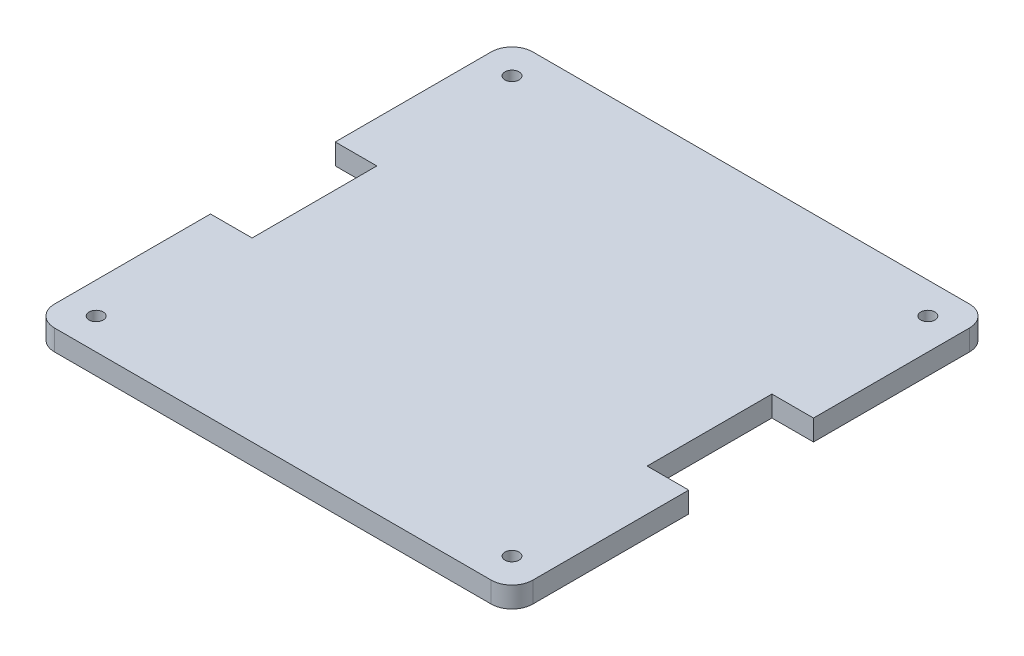
ISO-10303-21;
HEADER;
FILE_DESCRIPTION(('STEP AP214'),'2;1');
FILE_NAME('part.step','',(''),(''),'','','');
FILE_SCHEMA(('AUTOMOTIVE_DESIGN { 1 0 10303 214 1 1 1 1 }'));
ENDSEC;
DATA;
#1=APPLICATION_CONTEXT('core data for automotive mechanical design processes');
#2=APPLICATION_PROTOCOL_DEFINITION('international standard','automotive_design',2000,#1);
#3=PRODUCT_CONTEXT('',#1,'mechanical');
#4=PRODUCT('Part','Part','',(#3));
#5=PRODUCT_RELATED_PRODUCT_CATEGORY('part','',(#4));
#6=PRODUCT_DEFINITION_FORMATION('','',#4);
#7=PRODUCT_DEFINITION_CONTEXT('part definition',#1,'design');
#8=PRODUCT_DEFINITION('design','',#6,#7);
#9=PRODUCT_DEFINITION_SHAPE('','',#8);
#10=(LENGTH_UNIT() NAMED_UNIT(*) SI_UNIT(.MILLI.,.METRE.));
#11=(NAMED_UNIT(*) PLANE_ANGLE_UNIT() SI_UNIT($,.RADIAN.));
#12=(NAMED_UNIT(*) SI_UNIT($,.STERADIAN.) SOLID_ANGLE_UNIT());
#13=UNCERTAINTY_MEASURE_WITH_UNIT(LENGTH_MEASURE(1.E-05),#10,'distance_accuracy_value','');
#14=(GEOMETRIC_REPRESENTATION_CONTEXT(3) GLOBAL_UNCERTAINTY_ASSIGNED_CONTEXT((#13)) GLOBAL_UNIT_ASSIGNED_CONTEXT((#10,
#11,#12)) REPRESENTATION_CONTEXT('',''));
#15=CARTESIAN_POINT('',(0.,0.,0.));
#16=DIRECTION('',(0.,0.,1.));
#17=DIRECTION('',(1.,0.,0.));
#18=AXIS2_PLACEMENT_3D('',#15,#16,#17);
#19=CARTESIAN_POINT('',(-73.025,6.35,73.025));
#20=DIRECTION('',(1.,0.,0.));
#21=DIRECTION('',(0.,0.,-1.));
#22=AXIS2_PLACEMENT_3D('',#19,#20,#21);
#23=PLANE('',#22);
#24=DIRECTION('',(0.,1.,0.));
#25=VECTOR('',#24,1.);
#26=CARTESIAN_POINT('',(-73.025,-40.1609262841384,-19.05));
#27=LINE('',#26,#25);
#28=CARTESIAN_POINT('',(-73.025,0.,-19.05));
#29=VERTEX_POINT('',#28);
#30=CARTESIAN_POINT('',(-73.025,6.35,-19.05));
#31=VERTEX_POINT('',#30);
#32=EDGE_CURVE('E146',#29,#31,#27,.T.);
#33=ORIENTED_EDGE('',*,*,#32,.T.);
#34=DIRECTION('',(0.,0.,1.));
#35=VECTOR('',#34,1.);
#36=CARTESIAN_POINT('',(-73.025,6.35,73.025));
#37=LINE('',#36,#35);
#38=CARTESIAN_POINT('',(-73.025,6.35,-66.675));
#39=VERTEX_POINT('',#38);
#40=EDGE_CURVE('E239',#39,#31,#37,.T.);
#41=ORIENTED_EDGE('',*,*,#40,.F.);
#42=DIRECTION('',(0.,-1.,0.));
#43=VECTOR('',#42,1.);
#44=CARTESIAN_POINT('',(-73.025,6.35,-66.675));
#45=LINE('',#44,#43);
#46=CARTESIAN_POINT('',(-73.025,0.,-66.675));
#47=VERTEX_POINT('',#46);
#48=EDGE_CURVE('E167',#39,#47,#45,.T.);
#49=ORIENTED_EDGE('',*,*,#48,.T.);
#50=DIRECTION('',(0.,0.,1.));
#51=VECTOR('',#50,1.);
#52=CARTESIAN_POINT('',(-73.025,0.,73.025));
#53=LINE('',#52,#51);
#54=EDGE_CURVE('E161',#47,#29,#53,.T.);
#55=ORIENTED_EDGE('',*,*,#54,.T.);
#56=EDGE_LOOP('',(#33,#41,#49,#55));
#57=FACE_BOUND('',#56,.T.);
#58=ADVANCED_FACE('F33',(#57),#23,.F.);
#59=DIRECTION('',(0.,1.,0.));
#60=VECTOR('',#59,1.);
#61=CARTESIAN_POINT('',(-73.025,-40.1609262841384,19.05));
#62=LINE('',#61,#60);
#63=CARTESIAN_POINT('',(-73.025,0.,19.05));
#64=VERTEX_POINT('',#63);
#65=CARTESIAN_POINT('',(-73.025,6.35,19.05));
#66=VERTEX_POINT('',#65);
#67=EDGE_CURVE('E156',#64,#66,#62,.T.);
#68=ORIENTED_EDGE('',*,*,#67,.F.);
#69=CARTESIAN_POINT('',(-73.025,0.,66.675));
#70=VERTEX_POINT('',#69);
#71=EDGE_CURVE('E169',#64,#70,#53,.T.);
#72=ORIENTED_EDGE('',*,*,#71,.T.);
#73=DIRECTION('',(0.,-1.,0.));
#74=VECTOR('',#73,1.);
#75=CARTESIAN_POINT('',(-73.025,6.35,66.675));
#76=LINE('',#75,#74);
#77=CARTESIAN_POINT('',(-73.025,6.35,66.675));
#78=VERTEX_POINT('',#77);
#79=EDGE_CURVE('E195',#70,#78,#76,.F.);
#80=ORIENTED_EDGE('',*,*,#79,.T.);
#81=EDGE_CURVE('E225',#66,#78,#37,.T.);
#82=ORIENTED_EDGE('',*,*,#81,.F.);
#83=EDGE_LOOP('',(#68,#72,#80,#82));
#84=FACE_BOUND('',#83,.T.);
#85=ADVANCED_FACE('F311',(#84),#23,.F.);
#86=CARTESIAN_POINT('',(0.,6.35,0.));
#87=DIRECTION('',(0.,-1.,0.));
#88=DIRECTION('',(0.,0.,-1.));
#89=AXIS2_PLACEMENT_3D('',#86,#87,#88);
#90=PLANE('',#89);
#91=CARTESIAN_POINT('',(-63.5,6.35,-63.5));
#92=DIRECTION('',(0.,1.,0.));
#93=DIRECTION('',(0.,0.,1.));
#94=AXIS2_PLACEMENT_3D('',#91,#92,#93);
#95=CIRCLE('',#94,2.15265000000001);
#96=CARTESIAN_POINT('',(-63.5,6.35,-61.34735));
#97=VERTEX_POINT('',#96);
#98=EDGE_CURVE('E245',#97,#97,#95,.T.);
#99=ORIENTED_EDGE('',*,*,#98,.F.);
#100=EDGE_LOOP('',(#99));
#101=FACE_BOUND('',#100,.T.);
#102=CARTESIAN_POINT('',(63.5,6.35,-63.5));
#103=DIRECTION('',(0.,1.,0.));
#104=DIRECTION('',(0.,0.,1.));
#105=AXIS2_PLACEMENT_3D('',#102,#103,#104);
#106=CIRCLE('',#105,2.15265000000001);
#107=CARTESIAN_POINT('',(63.5,6.35,-61.34735));
#108=VERTEX_POINT('',#107);
#109=EDGE_CURVE('E251',#108,#108,#106,.T.);
#110=ORIENTED_EDGE('',*,*,#109,.F.);
#111=EDGE_LOOP('',(#110));
#112=FACE_BOUND('',#111,.T.);
#113=CARTESIAN_POINT('',(63.5,6.35,63.5));
#114=DIRECTION('',(0.,1.,0.));
#115=DIRECTION('',(0.,0.,1.));
#116=AXIS2_PLACEMENT_3D('',#113,#114,#115);
#117=CIRCLE('',#116,2.15265000000001);
#118=CARTESIAN_POINT('',(63.5,6.35,65.65265));
#119=VERTEX_POINT('',#118);
#120=EDGE_CURVE('E257',#119,#119,#117,.T.);
#121=ORIENTED_EDGE('',*,*,#120,.F.);
#122=EDGE_LOOP('',(#121));
#123=FACE_BOUND('',#122,.T.);
#124=CARTESIAN_POINT('',(-63.5,6.35,63.5));
#125=DIRECTION('',(0.,1.,0.));
#126=DIRECTION('',(0.,0.,1.));
#127=AXIS2_PLACEMENT_3D('',#124,#125,#126);
#128=CIRCLE('',#127,2.15265000000001);
#129=CARTESIAN_POINT('',(-63.5,6.35,65.65265));
#130=VERTEX_POINT('',#129);
#131=EDGE_CURVE('E263',#130,#130,#128,.T.);
#132=ORIENTED_EDGE('',*,*,#131,.F.);
#133=EDGE_LOOP('',(#132));
#134=FACE_BOUND('',#133,.T.);
#135=DIRECTION('',(1.,0.,0.));
#136=VECTOR('',#135,1.);
#137=CARTESIAN_POINT('',(-60.325,6.35,-19.05));
#138=LINE('',#137,#136);
#139=CARTESIAN_POINT('',(-60.325,6.35,-19.05));
#140=VERTEX_POINT('',#139);
#141=EDGE_CURVE('E151',#31,#140,#138,.T.);
#142=ORIENTED_EDGE('',*,*,#141,.T.);
#143=DIRECTION('',(0.,0.,1.));
#144=VECTOR('',#143,1.);
#145=CARTESIAN_POINT('',(-60.325,6.35,19.05));
#146=LINE('',#145,#144);
#147=CARTESIAN_POINT('',(-60.325,6.35,19.05));
#148=VERTEX_POINT('',#147);
#149=EDGE_CURVE('E293',#140,#148,#146,.T.);
#150=ORIENTED_EDGE('',*,*,#149,.T.);
#151=DIRECTION('',(-1.,0.,0.));
#152=VECTOR('',#151,1.);
#153=CARTESIAN_POINT('',(-73.025,6.35,19.05));
#154=LINE('',#153,#152);
#155=EDGE_CURVE('E292',#148,#66,#154,.T.);
#156=ORIENTED_EDGE('',*,*,#155,.T.);
#157=ORIENTED_EDGE('',*,*,#81,.T.);
#158=CARTESIAN_POINT('',(-66.675,6.35,66.675));
#159=DIRECTION('',(0.,-1.,0.));
#160=DIRECTION('',(0.,0.,-1.));
#161=AXIS2_PLACEMENT_3D('',#158,#159,#160);
#162=CIRCLE('',#161,6.35);
#163=CARTESIAN_POINT('',(-66.675,6.35,73.025));
#164=VERTEX_POINT('',#163);
#165=EDGE_CURVE('E204',#78,#164,#162,.F.);
#166=ORIENTED_EDGE('',*,*,#165,.T.);
#167=DIRECTION('',(1.,0.,0.));
#168=VECTOR('',#167,1.);
#169=CARTESIAN_POINT('',(-73.025,6.35,73.025));
#170=LINE('',#169,#168);
#171=CARTESIAN_POINT('',(66.675,6.35,73.025));
#172=VERTEX_POINT('',#171);
#173=EDGE_CURVE('E181',#164,#172,#170,.T.);
#174=ORIENTED_EDGE('',*,*,#173,.T.);
#175=CARTESIAN_POINT('',(66.675,6.35,66.675));
#176=DIRECTION('',(0.,-1.,0.));
#177=DIRECTION('',(0.,0.,-1.));
#178=AXIS2_PLACEMENT_3D('',#175,#176,#177);
#179=CIRCLE('',#178,6.35);
#180=CARTESIAN_POINT('',(73.025,6.35,66.675));
#181=VERTEX_POINT('',#180);
#182=EDGE_CURVE('E202',#172,#181,#179,.F.);
#183=ORIENTED_EDGE('',*,*,#182,.T.);
#184=DIRECTION('',(0.,0.,-1.));
#185=VECTOR('',#184,1.);
#186=CARTESIAN_POINT('',(73.025,6.35,73.025));
#187=LINE('',#186,#185);
#188=CARTESIAN_POINT('',(73.025,6.35,19.05));
#189=VERTEX_POINT('',#188);
#190=EDGE_CURVE('E226',#181,#189,#187,.T.);
#191=ORIENTED_EDGE('',*,*,#190,.T.);
#192=DIRECTION('',(1.,0.,0.));
#193=VECTOR('',#192,1.);
#194=CARTESIAN_POINT('',(73.025,6.35,19.05));
#195=LINE('',#194,#193);
#196=CARTESIAN_POINT('',(60.325,6.35,19.05));
#197=VERTEX_POINT('',#196);
#198=EDGE_CURVE('E281',#197,#189,#195,.T.);
#199=ORIENTED_EDGE('',*,*,#198,.F.);
#200=DIRECTION('',(0.,0.,1.));
#201=VECTOR('',#200,1.);
#202=CARTESIAN_POINT('',(60.325,6.35,19.05));
#203=LINE('',#202,#201);
#204=CARTESIAN_POINT('',(60.325,6.35,-19.05));
#205=VERTEX_POINT('',#204);
#206=EDGE_CURVE('E285',#205,#197,#203,.T.);
#207=ORIENTED_EDGE('',*,*,#206,.F.);
#208=DIRECTION('',(-1.,0.,0.));
#209=VECTOR('',#208,1.);
#210=CARTESIAN_POINT('',(60.325,6.35,-19.05));
#211=LINE('',#210,#209);
#212=CARTESIAN_POINT('',(73.025,6.35,-19.05));
#213=VERTEX_POINT('',#212);
#214=EDGE_CURVE('E282',#213,#205,#211,.T.);
#215=ORIENTED_EDGE('',*,*,#214,.F.);
#216=CARTESIAN_POINT('',(73.025,6.35,-66.675));
#217=VERTEX_POINT('',#216);
#218=EDGE_CURVE('E172',#213,#217,#187,.T.);
#219=ORIENTED_EDGE('',*,*,#218,.T.);
#220=CARTESIAN_POINT('',(66.675,6.35,-66.675));
#221=DIRECTION('',(0.,-1.,0.));
#222=DIRECTION('',(0.,0.,-1.));
#223=AXIS2_PLACEMENT_3D('',#220,#221,#222);
#224=CIRCLE('',#223,6.35);
#225=CARTESIAN_POINT('',(66.675,6.35,-73.025));
#226=VERTEX_POINT('',#225);
#227=EDGE_CURVE('E200',#217,#226,#224,.F.);
#228=ORIENTED_EDGE('',*,*,#227,.T.);
#229=DIRECTION('',(-1.,0.,0.));
#230=VECTOR('',#229,1.);
#231=CARTESIAN_POINT('',(-73.025,6.35,-73.025));
#232=LINE('',#231,#230);
#233=CARTESIAN_POINT('',(-66.675,6.35,-73.025));
#234=VERTEX_POINT('',#233);
#235=EDGE_CURVE('E217',#226,#234,#232,.T.);
#236=ORIENTED_EDGE('',*,*,#235,.T.);
#237=CARTESIAN_POINT('',(-66.675,6.35,-66.675));
#238=DIRECTION('',(0.,-1.,0.));
#239=DIRECTION('',(0.,0.,-1.));
#240=AXIS2_PLACEMENT_3D('',#237,#238,#239);
#241=CIRCLE('',#240,6.35);
#242=EDGE_CURVE('E198',#234,#39,#241,.F.);
#243=ORIENTED_EDGE('',*,*,#242,.T.);
#244=ORIENTED_EDGE('',*,*,#40,.T.);
#245=EDGE_LOOP('',(#142,#150,#156,#157,#166,#174,#183,#191,#199,#207,#215,#219,#228,#236,#243,#244));
#246=FACE_BOUND('',#245,.T.);
#247=ADVANCED_FACE('F223',(#101,#112,#123,#134,#246),#90,.F.);
#248=CARTESIAN_POINT('',(0.,0.,0.));
#249=DIRECTION('',(0.,-1.,0.));
#250=DIRECTION('',(0.,0.,-1.));
#251=AXIS2_PLACEMENT_3D('',#248,#249,#250);
#252=PLANE('',#251);
#253=CARTESIAN_POINT('',(-63.5,0.,63.5));
#254=DIRECTION('',(0.,-1.,0.));
#255=DIRECTION('',(0.,0.,-1.));
#256=AXIS2_PLACEMENT_3D('',#253,#254,#255);
#257=CIRCLE('',#256,2.15265000000001);
#258=CARTESIAN_POINT('',(-63.5,0.,61.34735));
#259=VERTEX_POINT('',#258);
#260=EDGE_CURVE('E260',#259,#259,#257,.F.);
#261=ORIENTED_EDGE('',*,*,#260,.T.);
#262=EDGE_LOOP('',(#261));
#263=FACE_BOUND('',#262,.T.);
#264=CARTESIAN_POINT('',(63.5,0.,63.5));
#265=DIRECTION('',(0.,-1.,0.));
#266=DIRECTION('',(0.,0.,-1.));
#267=AXIS2_PLACEMENT_3D('',#264,#265,#266);
#268=CIRCLE('',#267,2.15265000000001);
#269=CARTESIAN_POINT('',(63.5,0.,61.34735));
#270=VERTEX_POINT('',#269);
#271=EDGE_CURVE('E254',#270,#270,#268,.F.);
#272=ORIENTED_EDGE('',*,*,#271,.T.);
#273=EDGE_LOOP('',(#272));
#274=FACE_BOUND('',#273,.T.);
#275=CARTESIAN_POINT('',(63.5,0.,-63.5));
#276=DIRECTION('',(0.,-1.,0.));
#277=DIRECTION('',(0.,0.,-1.));
#278=AXIS2_PLACEMENT_3D('',#275,#276,#277);
#279=CIRCLE('',#278,2.15265000000001);
#280=CARTESIAN_POINT('',(63.5,0.,-65.65265));
#281=VERTEX_POINT('',#280);
#282=EDGE_CURVE('E248',#281,#281,#279,.F.);
#283=ORIENTED_EDGE('',*,*,#282,.T.);
#284=EDGE_LOOP('',(#283));
#285=FACE_BOUND('',#284,.T.);
#286=CARTESIAN_POINT('',(-63.5,0.,-63.5));
#287=DIRECTION('',(0.,-1.,0.));
#288=DIRECTION('',(0.,0.,-1.));
#289=AXIS2_PLACEMENT_3D('',#286,#287,#288);
#290=CIRCLE('',#289,2.15265000000001);
#291=CARTESIAN_POINT('',(-63.5,0.,-65.65265));
#292=VERTEX_POINT('',#291);
#293=EDGE_CURVE('E235',#292,#292,#290,.F.);
#294=ORIENTED_EDGE('',*,*,#293,.T.);
#295=EDGE_LOOP('',(#294));
#296=FACE_BOUND('',#295,.T.);
#297=DIRECTION('',(0.,0.,1.));
#298=VECTOR('',#297,1.);
#299=CARTESIAN_POINT('',(-60.325,0.,19.05));
#300=LINE('',#299,#298);
#301=CARTESIAN_POINT('',(-60.325,0.,-19.05));
#302=VERTEX_POINT('',#301);
#303=CARTESIAN_POINT('',(-60.325,0.,19.05));
#304=VERTEX_POINT('',#303);
#305=EDGE_CURVE('E48',#302,#304,#300,.T.);
#306=ORIENTED_EDGE('',*,*,#305,.F.);
#307=DIRECTION('',(1.,0.,0.));
#308=VECTOR('',#307,1.);
#309=CARTESIAN_POINT('',(-60.325,0.,-19.05));
#310=LINE('',#309,#308);
#311=EDGE_CURVE('E149',#29,#302,#310,.T.);
#312=ORIENTED_EDGE('',*,*,#311,.F.);
#313=ORIENTED_EDGE('',*,*,#54,.F.);
#314=CARTESIAN_POINT('',(-66.675,0.,-66.675));
#315=DIRECTION('',(0.,-1.,0.));
#316=DIRECTION('',(0.,0.,-1.));
#317=AXIS2_PLACEMENT_3D('',#314,#315,#316);
#318=CIRCLE('',#317,6.35);
#319=CARTESIAN_POINT('',(-66.675,0.,-73.025));
#320=VERTEX_POINT('',#319);
#321=EDGE_CURVE('E184',#47,#320,#318,.T.);
#322=ORIENTED_EDGE('',*,*,#321,.T.);
#323=DIRECTION('',(-1.,0.,0.));
#324=VECTOR('',#323,1.);
#325=CARTESIAN_POINT('',(-73.025,0.,-73.025));
#326=LINE('',#325,#324);
#327=CARTESIAN_POINT('',(66.675,0.,-73.025));
#328=VERTEX_POINT('',#327);
#329=EDGE_CURVE('E174',#328,#320,#326,.T.);
#330=ORIENTED_EDGE('',*,*,#329,.F.);
#331=CARTESIAN_POINT('',(66.675,0.,-66.675));
#332=DIRECTION('',(0.,-1.,0.));
#333=DIRECTION('',(0.,0.,-1.));
#334=AXIS2_PLACEMENT_3D('',#331,#332,#333);
#335=CIRCLE('',#334,6.35);
#336=CARTESIAN_POINT('',(73.025,0.,-66.675));
#337=VERTEX_POINT('',#336);
#338=EDGE_CURVE('E186',#328,#337,#335,.T.);
#339=ORIENTED_EDGE('',*,*,#338,.T.);
#340=DIRECTION('',(0.,0.,-1.));
#341=VECTOR('',#340,1.);
#342=CARTESIAN_POINT('',(73.025,0.,73.025));
#343=LINE('',#342,#341);
#344=CARTESIAN_POINT('',(73.025,0.,-19.05));
#345=VERTEX_POINT('',#344);
#346=EDGE_CURVE('E232',#345,#337,#343,.T.);
#347=ORIENTED_EDGE('',*,*,#346,.F.);
#348=DIRECTION('',(-1.,0.,0.));
#349=VECTOR('',#348,1.);
#350=CARTESIAN_POINT('',(60.325,0.,-19.05));
#351=LINE('',#350,#349);
#352=CARTESIAN_POINT('',(60.325,0.,-19.05));
#353=VERTEX_POINT('',#352);
#354=EDGE_CURVE('E271',#345,#353,#351,.T.);
#355=ORIENTED_EDGE('',*,*,#354,.T.);
#356=DIRECTION('',(0.,0.,1.));
#357=VECTOR('',#356,1.);
#358=CARTESIAN_POINT('',(60.325,0.,19.05));
#359=LINE('',#358,#357);
#360=CARTESIAN_POINT('',(60.325,0.,19.05));
#361=VERTEX_POINT('',#360);
#362=EDGE_CURVE('E270',#353,#361,#359,.T.);
#363=ORIENTED_EDGE('',*,*,#362,.T.);
#364=DIRECTION('',(1.,0.,0.));
#365=VECTOR('',#364,1.);
#366=CARTESIAN_POINT('',(73.025,0.,19.05));
#367=LINE('',#366,#365);
#368=CARTESIAN_POINT('',(73.025,0.,19.05));
#369=VERTEX_POINT('',#368);
#370=EDGE_CURVE('E274',#361,#369,#367,.T.);
#371=ORIENTED_EDGE('',*,*,#370,.T.);
#372=CARTESIAN_POINT('',(73.025,0.,66.675));
#373=VERTEX_POINT('',#372);
#374=EDGE_CURVE('E230',#373,#369,#343,.T.);
#375=ORIENTED_EDGE('',*,*,#374,.F.);
#376=CARTESIAN_POINT('',(66.675,0.,66.675));
#377=DIRECTION('',(0.,-1.,0.));
#378=DIRECTION('',(0.,0.,-1.));
#379=AXIS2_PLACEMENT_3D('',#376,#377,#378);
#380=CIRCLE('',#379,6.35);
#381=CARTESIAN_POINT('',(66.675,0.,73.025));
#382=VERTEX_POINT('',#381);
#383=EDGE_CURVE('E189',#373,#382,#380,.T.);
#384=ORIENTED_EDGE('',*,*,#383,.T.);
#385=DIRECTION('',(1.,0.,0.));
#386=VECTOR('',#385,1.);
#387=CARTESIAN_POINT('',(-73.025,0.,73.025));
#388=LINE('',#387,#386);
#389=CARTESIAN_POINT('',(-66.675,0.,73.025));
#390=VERTEX_POINT('',#389);
#391=EDGE_CURVE('E168',#390,#382,#388,.T.);
#392=ORIENTED_EDGE('',*,*,#391,.F.);
#393=CARTESIAN_POINT('',(-66.675,0.,66.675));
#394=DIRECTION('',(0.,-1.,0.));
#395=DIRECTION('',(0.,0.,-1.));
#396=AXIS2_PLACEMENT_3D('',#393,#394,#395);
#397=CIRCLE('',#396,6.35);
#398=EDGE_CURVE('E191',#390,#70,#397,.T.);
#399=ORIENTED_EDGE('',*,*,#398,.T.);
#400=ORIENTED_EDGE('',*,*,#71,.F.);
#401=DIRECTION('',(-1.,0.,0.));
#402=VECTOR('',#401,1.);
#403=CARTESIAN_POINT('',(-73.025,0.,19.05));
#404=LINE('',#403,#402);
#405=EDGE_CURVE('E163',#304,#64,#404,.T.);
#406=ORIENTED_EDGE('',*,*,#405,.F.);
#407=EDGE_LOOP('',(#306,#312,#313,#322,#330,#339,#347,#355,#363,#371,#375,#384,#392,#399,#400,#406));
#408=FACE_BOUND('',#407,.T.);
#409=ADVANCED_FACE('F160',(#263,#274,#285,#296,#408),#252,.T.);
#410=CARTESIAN_POINT('',(73.025,6.35,73.025));
#411=DIRECTION('',(-1.,0.,0.));
#412=DIRECTION('',(0.,0.,1.));
#413=AXIS2_PLACEMENT_3D('',#410,#411,#412);
#414=PLANE('',#413);
#415=ORIENTED_EDGE('',*,*,#218,.F.);
#416=DIRECTION('',(0.,1.,0.));
#417=VECTOR('',#416,1.);
#418=CARTESIAN_POINT('',(73.025,-40.1609262841384,-19.05));
#419=LINE('',#418,#417);
#420=EDGE_CURVE('E266',#345,#213,#419,.T.);
#421=ORIENTED_EDGE('',*,*,#420,.F.);
#422=ORIENTED_EDGE('',*,*,#346,.T.);
#423=DIRECTION('',(0.,-1.,0.));
#424=VECTOR('',#423,1.);
#425=CARTESIAN_POINT('',(73.025,6.35,-66.675));
#426=LINE('',#425,#424);
#427=EDGE_CURVE('E206',#337,#217,#426,.F.);
#428=ORIENTED_EDGE('',*,*,#427,.T.);
#429=EDGE_LOOP('',(#415,#421,#422,#428));
#430=FACE_BOUND('',#429,.T.);
#431=ADVANCED_FACE('F340',(#430),#414,.F.);
#432=ORIENTED_EDGE('',*,*,#374,.T.);
#433=DIRECTION('',(0.,1.,0.));
#434=VECTOR('',#433,1.);
#435=CARTESIAN_POINT('',(73.025,-40.1609262841384,19.05));
#436=LINE('',#435,#434);
#437=EDGE_CURVE('E56',#369,#189,#436,.T.);
#438=ORIENTED_EDGE('',*,*,#437,.T.);
#439=ORIENTED_EDGE('',*,*,#190,.F.);
#440=DIRECTION('',(0.,-1.,0.));
#441=VECTOR('',#440,1.);
#442=CARTESIAN_POINT('',(73.025,6.35,66.675));
#443=LINE('',#442,#441);
#444=EDGE_CURVE('E209',#181,#373,#443,.T.);
#445=ORIENTED_EDGE('',*,*,#444,.T.);
#446=EDGE_LOOP('',(#432,#438,#439,#445));
#447=FACE_BOUND('',#446,.T.);
#448=ADVANCED_FACE('F328',(#447),#414,.F.);
#449=CARTESIAN_POINT('',(-73.025,6.35,-73.025));
#450=DIRECTION('',(0.,0.,1.));
#451=DIRECTION('',(1.,0.,0.));
#452=AXIS2_PLACEMENT_3D('',#449,#450,#451);
#453=PLANE('',#452);
#454=ORIENTED_EDGE('',*,*,#235,.F.);
#455=DIRECTION('',(0.,-1.,0.));
#456=VECTOR('',#455,1.);
#457=CARTESIAN_POINT('',(66.675,6.35,-73.025));
#458=LINE('',#457,#456);
#459=EDGE_CURVE('E11',#226,#328,#458,.T.);
#460=ORIENTED_EDGE('',*,*,#459,.T.);
#461=ORIENTED_EDGE('',*,*,#329,.T.);
#462=DIRECTION('',(0.,-1.,0.));
#463=VECTOR('',#462,1.);
#464=CARTESIAN_POINT('',(-66.675,6.35,-73.025));
#465=LINE('',#464,#463);
#466=EDGE_CURVE('E41',#320,#234,#465,.F.);
#467=ORIENTED_EDGE('',*,*,#466,.T.);
#468=EDGE_LOOP('',(#454,#460,#461,#467));
#469=FACE_BOUND('',#468,.T.);
#470=ADVANCED_FACE('F216',(#469),#453,.F.);
#471=CARTESIAN_POINT('',(-73.025,6.35,73.025));
#472=DIRECTION('',(0.,0.,-1.));
#473=DIRECTION('',(-1.,0.,0.));
#474=AXIS2_PLACEMENT_3D('',#471,#472,#473);
#475=PLANE('',#474);
#476=ORIENTED_EDGE('',*,*,#173,.F.);
#477=DIRECTION('',(0.,-1.,0.));
#478=VECTOR('',#477,1.);
#479=CARTESIAN_POINT('',(-66.675,6.35,73.025));
#480=LINE('',#479,#478);
#481=EDGE_CURVE('E180',#164,#390,#480,.T.);
#482=ORIENTED_EDGE('',*,*,#481,.T.);
#483=ORIENTED_EDGE('',*,*,#391,.T.);
#484=DIRECTION('',(0.,-1.,0.));
#485=VECTOR('',#484,1.);
#486=CARTESIAN_POINT('',(66.675,6.35,73.025));
#487=LINE('',#486,#485);
#488=EDGE_CURVE('E178',#382,#172,#487,.F.);
#489=ORIENTED_EDGE('',*,*,#488,.T.);
#490=EDGE_LOOP('',(#476,#482,#483,#489));
#491=FACE_BOUND('',#490,.T.);
#492=ADVANCED_FACE('F321',(#491),#475,.F.);
#493=CARTESIAN_POINT('',(-63.5,-6.0886136500849,-63.5));
#494=DIRECTION('',(0.,1.,0.));
#495=DIRECTION('',(0.,0.,1.));
#496=AXIS2_PLACEMENT_3D('',#493,#494,#495);
#497=CYLINDRICAL_SURFACE('',#496,2.15265000000001);
#498=ORIENTED_EDGE('',*,*,#98,.T.);
#499=EDGE_LOOP('',(#498));
#500=FACE_BOUND('',#499,.T.);
#501=ORIENTED_EDGE('',*,*,#293,.F.);
#502=EDGE_LOOP('',(#501));
#503=FACE_BOUND('',#502,.T.);
#504=ADVANCED_FACE('F383',(#500,#503),#497,.F.);
#505=CARTESIAN_POINT('',(63.5,-6.0886136500849,-63.5));
#506=DIRECTION('',(0.,1.,0.));
#507=DIRECTION('',(0.,0.,1.));
#508=AXIS2_PLACEMENT_3D('',#505,#506,#507);
#509=CYLINDRICAL_SURFACE('',#508,2.15265000000001);
#510=ORIENTED_EDGE('',*,*,#109,.T.);
#511=EDGE_LOOP('',(#510));
#512=FACE_BOUND('',#511,.T.);
#513=ORIENTED_EDGE('',*,*,#282,.F.);
#514=EDGE_LOOP('',(#513));
#515=FACE_BOUND('',#514,.T.);
#516=ADVANCED_FACE('F374',(#512,#515),#509,.F.);
#517=CARTESIAN_POINT('',(63.5,-6.0886136500849,63.5));
#518=DIRECTION('',(0.,1.,0.));
#519=DIRECTION('',(0.,0.,1.));
#520=AXIS2_PLACEMENT_3D('',#517,#518,#519);
#521=CYLINDRICAL_SURFACE('',#520,2.15265000000001);
#522=ORIENTED_EDGE('',*,*,#120,.T.);
#523=EDGE_LOOP('',(#522));
#524=FACE_BOUND('',#523,.T.);
#525=ORIENTED_EDGE('',*,*,#271,.F.);
#526=EDGE_LOOP('',(#525));
#527=FACE_BOUND('',#526,.T.);
#528=ADVANCED_FACE('F368',(#524,#527),#521,.F.);
#529=CARTESIAN_POINT('',(-63.5,-6.0886136500849,63.5));
#530=DIRECTION('',(0.,1.,0.));
#531=DIRECTION('',(0.,0.,1.));
#532=AXIS2_PLACEMENT_3D('',#529,#530,#531);
#533=CYLINDRICAL_SURFACE('',#532,2.15265000000001);
#534=ORIENTED_EDGE('',*,*,#131,.T.);
#535=EDGE_LOOP('',(#534));
#536=FACE_BOUND('',#535,.T.);
#537=ORIENTED_EDGE('',*,*,#260,.F.);
#538=EDGE_LOOP('',(#537));
#539=FACE_BOUND('',#538,.T.);
#540=ADVANCED_FACE('F364',(#536,#539),#533,.F.);
#541=CARTESIAN_POINT('',(-66.675,6.35,66.675));
#542=DIRECTION('',(0.,-1.,0.));
#543=DIRECTION('',(0.,0.,-1.));
#544=AXIS2_PLACEMENT_3D('',#541,#542,#543);
#545=CYLINDRICAL_SURFACE('',#544,6.35);
#546=ORIENTED_EDGE('',*,*,#165,.F.);
#547=ORIENTED_EDGE('',*,*,#79,.F.);
#548=ORIENTED_EDGE('',*,*,#398,.F.);
#549=ORIENTED_EDGE('',*,*,#481,.F.);
#550=EDGE_LOOP('',(#546,#547,#548,#549));
#551=FACE_BOUND('',#550,.T.);
#552=ADVANCED_FACE('F317',(#551),#545,.T.);
#553=CARTESIAN_POINT('',(66.675,6.35,66.675));
#554=DIRECTION('',(0.,-1.,0.));
#555=DIRECTION('',(0.,0.,-1.));
#556=AXIS2_PLACEMENT_3D('',#553,#554,#555);
#557=CYLINDRICAL_SURFACE('',#556,6.35);
#558=ORIENTED_EDGE('',*,*,#182,.F.);
#559=ORIENTED_EDGE('',*,*,#488,.F.);
#560=ORIENTED_EDGE('',*,*,#383,.F.);
#561=ORIENTED_EDGE('',*,*,#444,.F.);
#562=EDGE_LOOP('',(#558,#559,#560,#561));
#563=FACE_BOUND('',#562,.T.);
#564=ADVANCED_FACE('F324',(#563),#557,.T.);
#565=CARTESIAN_POINT('',(66.675,6.35,-66.675));
#566=DIRECTION('',(0.,-1.,0.));
#567=DIRECTION('',(0.,0.,-1.));
#568=AXIS2_PLACEMENT_3D('',#565,#566,#567);
#569=CYLINDRICAL_SURFACE('',#568,6.35);
#570=ORIENTED_EDGE('',*,*,#227,.F.);
#571=ORIENTED_EDGE('',*,*,#427,.F.);
#572=ORIENTED_EDGE('',*,*,#338,.F.);
#573=ORIENTED_EDGE('',*,*,#459,.F.);
#574=EDGE_LOOP('',(#570,#571,#572,#573));
#575=FACE_BOUND('',#574,.T.);
#576=ADVANCED_FACE('F342',(#575),#569,.T.);
#577=CARTESIAN_POINT('',(-66.675,6.35,-66.675));
#578=DIRECTION('',(0.,-1.,0.));
#579=DIRECTION('',(0.,0.,-1.));
#580=AXIS2_PLACEMENT_3D('',#577,#578,#579);
#581=CYLINDRICAL_SURFACE('',#580,6.35);
#582=ORIENTED_EDGE('',*,*,#242,.F.);
#583=ORIENTED_EDGE('',*,*,#466,.F.);
#584=ORIENTED_EDGE('',*,*,#321,.F.);
#585=ORIENTED_EDGE('',*,*,#48,.F.);
#586=EDGE_LOOP('',(#582,#583,#584,#585));
#587=FACE_BOUND('',#586,.T.);
#588=ADVANCED_FACE('F35',(#587),#581,.T.);
#589=CARTESIAN_POINT('',(60.325,-40.1609262841384,-19.05));
#590=DIRECTION('',(0.,0.,-1.));
#591=DIRECTION('',(-1.,0.,0.));
#592=AXIS2_PLACEMENT_3D('',#589,#590,#591);
#593=PLANE('',#592);
#594=ORIENTED_EDGE('',*,*,#420,.T.);
#595=ORIENTED_EDGE('',*,*,#214,.T.);
#596=DIRECTION('',(0.,1.,0.));
#597=VECTOR('',#596,1.);
#598=CARTESIAN_POINT('',(60.325,-40.1609262841384,-19.05));
#599=LINE('',#598,#597);
#600=EDGE_CURVE('E268',#353,#205,#599,.T.);
#601=ORIENTED_EDGE('',*,*,#600,.F.);
#602=ORIENTED_EDGE('',*,*,#354,.F.);
#603=EDGE_LOOP('',(#594,#595,#601,#602));
#604=FACE_BOUND('',#603,.T.);
#605=ADVANCED_FACE('F348',(#604),#593,.F.);
#606=CARTESIAN_POINT('',(60.325,-40.1609262841384,19.05));
#607=DIRECTION('',(-1.,0.,0.));
#608=DIRECTION('',(0.,0.,1.));
#609=AXIS2_PLACEMENT_3D('',#606,#607,#608);
#610=PLANE('',#609);
#611=ORIENTED_EDGE('',*,*,#600,.T.);
#612=ORIENTED_EDGE('',*,*,#206,.T.);
#613=DIRECTION('',(0.,1.,0.));
#614=VECTOR('',#613,1.);
#615=CARTESIAN_POINT('',(60.325,-40.1609262841384,19.05));
#616=LINE('',#615,#614);
#617=EDGE_CURVE('E272',#361,#197,#616,.T.);
#618=ORIENTED_EDGE('',*,*,#617,.F.);
#619=ORIENTED_EDGE('',*,*,#362,.F.);
#620=EDGE_LOOP('',(#611,#612,#618,#619));
#621=FACE_BOUND('',#620,.T.);
#622=ADVANCED_FACE('F332',(#621),#610,.F.);
#623=CARTESIAN_POINT('',(73.025,-40.1609262841384,19.05));
#624=DIRECTION('',(0.,0.,1.));
#625=DIRECTION('',(1.,0.,0.));
#626=AXIS2_PLACEMENT_3D('',#623,#624,#625);
#627=PLANE('',#626);
#628=ORIENTED_EDGE('',*,*,#617,.T.);
#629=ORIENTED_EDGE('',*,*,#198,.T.);
#630=ORIENTED_EDGE('',*,*,#437,.F.);
#631=ORIENTED_EDGE('',*,*,#370,.F.);
#632=EDGE_LOOP('',(#628,#629,#630,#631));
#633=FACE_BOUND('',#632,.T.);
#634=ADVANCED_FACE('F330',(#633),#627,.F.);
#635=CARTESIAN_POINT('',(-60.325,-40.1609262841384,-19.05));
#636=DIRECTION('',(0.,0.,1.));
#637=DIRECTION('',(1.,0.,0.));
#638=AXIS2_PLACEMENT_3D('',#635,#636,#637);
#639=PLANE('',#638);
#640=ORIENTED_EDGE('',*,*,#311,.T.);
#641=DIRECTION('',(0.,1.,0.));
#642=VECTOR('',#641,1.);
#643=CARTESIAN_POINT('',(-60.325,-40.1609262841384,-19.05));
#644=LINE('',#643,#642);
#645=EDGE_CURVE('E294',#302,#140,#644,.T.);
#646=ORIENTED_EDGE('',*,*,#645,.T.);
#647=ORIENTED_EDGE('',*,*,#141,.F.);
#648=ORIENTED_EDGE('',*,*,#32,.F.);
#649=EDGE_LOOP('',(#640,#646,#647,#648));
#650=FACE_BOUND('',#649,.T.);
#651=ADVANCED_FACE('F148',(#650),#639,.T.);
#652=CARTESIAN_POINT('',(-60.325,-40.1609262841384,19.05));
#653=DIRECTION('',(-1.,0.,0.));
#654=DIRECTION('',(0.,0.,1.));
#655=AXIS2_PLACEMENT_3D('',#652,#653,#654);
#656=PLANE('',#655);
#657=ORIENTED_EDGE('',*,*,#305,.T.);
#658=DIRECTION('',(0.,1.,0.));
#659=VECTOR('',#658,1.);
#660=CARTESIAN_POINT('',(-60.325,-40.1609262841384,19.05));
#661=LINE('',#660,#659);
#662=EDGE_CURVE('E290',#304,#148,#661,.T.);
#663=ORIENTED_EDGE('',*,*,#662,.T.);
#664=ORIENTED_EDGE('',*,*,#149,.F.);
#665=ORIENTED_EDGE('',*,*,#645,.F.);
#666=EDGE_LOOP('',(#657,#663,#664,#665));
#667=FACE_BOUND('',#666,.T.);
#668=ADVANCED_FACE('F305',(#667),#656,.T.);
#669=CARTESIAN_POINT('',(-73.025,-40.1609262841384,19.05));
#670=DIRECTION('',(0.,0.,-1.));
#671=DIRECTION('',(-1.,0.,0.));
#672=AXIS2_PLACEMENT_3D('',#669,#670,#671);
#673=PLANE('',#672);
#674=ORIENTED_EDGE('',*,*,#405,.T.);
#675=ORIENTED_EDGE('',*,*,#67,.T.);
#676=ORIENTED_EDGE('',*,*,#155,.F.);
#677=ORIENTED_EDGE('',*,*,#662,.F.);
#678=EDGE_LOOP('',(#674,#675,#676,#677));
#679=FACE_BOUND('',#678,.T.);
#680=ADVANCED_FACE('F307',(#679),#673,.T.);
#681=CLOSED_SHELL('',(#58,#85,#247,#409,#431,#448,#470,#492,#504,#516,#528,#540,#552,#564,#576,
#588,#605,#622,#634,#651,#668,#680));
#682=MANIFOLD_SOLID_BREP('B2',#681);
#683=ADVANCED_BREP_SHAPE_REPRESENTATION('',(#18,#682),#14);
#684=SHAPE_DEFINITION_REPRESENTATION(#9,#683);
ENDSEC;
END-ISO-10303-21;
